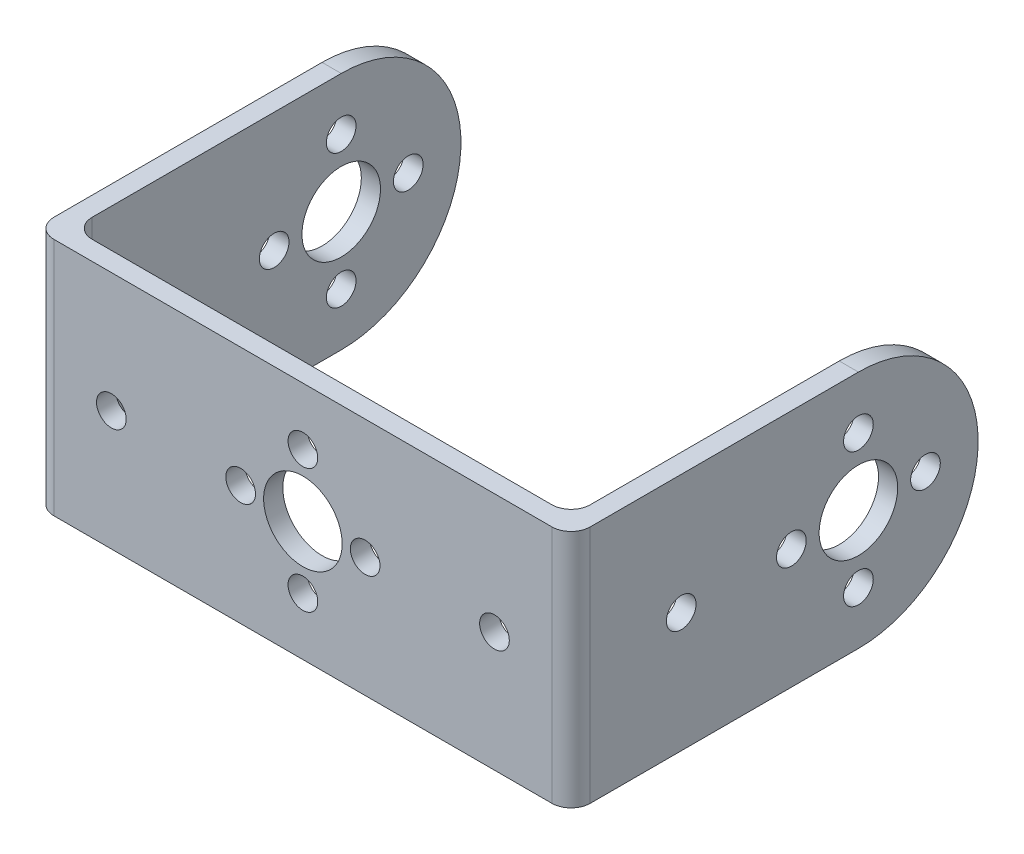
ISO-10303-21;
HEADER;
FILE_DESCRIPTION(('STEP AP214'),'2;1');
FILE_NAME('part.step','',(''),(''),'','','');
FILE_SCHEMA(('AUTOMOTIVE_DESIGN { 1 0 10303 214 1 1 1 1 }'));
ENDSEC;
DATA;
#1=APPLICATION_CONTEXT('core data for automotive mechanical design processes');
#2=APPLICATION_PROTOCOL_DEFINITION('international standard','automotive_design',2000,#1);
#3=PRODUCT_CONTEXT('',#1,'mechanical');
#4=PRODUCT('Part','Part','',(#3));
#5=PRODUCT_RELATED_PRODUCT_CATEGORY('part','',(#4));
#6=PRODUCT_DEFINITION_FORMATION('','',#4);
#7=PRODUCT_DEFINITION_CONTEXT('part definition',#1,'design');
#8=PRODUCT_DEFINITION('design','',#6,#7);
#9=PRODUCT_DEFINITION_SHAPE('','',#8);
#10=(LENGTH_UNIT() NAMED_UNIT(*) SI_UNIT(.MILLI.,.METRE.));
#11=(NAMED_UNIT(*) PLANE_ANGLE_UNIT() SI_UNIT($,.RADIAN.));
#12=(NAMED_UNIT(*) SI_UNIT($,.STERADIAN.) SOLID_ANGLE_UNIT());
#13=UNCERTAINTY_MEASURE_WITH_UNIT(LENGTH_MEASURE(1.E-05),#10,'distance_accuracy_value','');
#14=(GEOMETRIC_REPRESENTATION_CONTEXT(3) GLOBAL_UNCERTAINTY_ASSIGNED_CONTEXT((#13)) GLOBAL_UNIT_ASSIGNED_CONTEXT((#10,
#11,#12)) REPRESENTATION_CONTEXT('',''));
#15=CARTESIAN_POINT('',(0.,0.,0.));
#16=DIRECTION('',(0.,0.,1.));
#17=DIRECTION('',(1.,0.,0.));
#18=AXIS2_PLACEMENT_3D('',#15,#16,#17);
#19=CARTESIAN_POINT('',(0.,0.,0.));
#20=DIRECTION('',(0.,0.,-1.));
#21=DIRECTION('',(-1.,0.,0.));
#22=AXIS2_PLACEMENT_3D('',#19,#20,#21);
#23=PLANE('',#22);
#24=CARTESIAN_POINT('',(-20.,0.,0.));
#25=DIRECTION('',(0.,0.,1.));
#26=DIRECTION('',(1.,0.,0.));
#27=AXIS2_PLACEMENT_3D('',#24,#25,#26);
#28=CIRCLE('',#27,1.54999999999998);
#29=CARTESIAN_POINT('',(-18.45,0.,0.));
#30=VERTEX_POINT('',#29);
#31=EDGE_CURVE('E281',#30,#30,#28,.T.);
#32=ORIENTED_EDGE('',*,*,#31,.T.);
#33=EDGE_LOOP('',(#32));
#34=FACE_BOUND('',#33,.T.);
#35=CARTESIAN_POINT('',(20.,0.,0.));
#36=DIRECTION('',(0.,0.,1.));
#37=DIRECTION('',(1.,0.,0.));
#38=AXIS2_PLACEMENT_3D('',#35,#36,#37);
#39=CIRCLE('',#38,1.54999999999998);
#40=CARTESIAN_POINT('',(21.55,0.,0.));
#41=VERTEX_POINT('',#40);
#42=EDGE_CURVE('E456',#41,#41,#39,.T.);
#43=ORIENTED_EDGE('',*,*,#42,.T.);
#44=EDGE_LOOP('',(#43));
#45=FACE_BOUND('',#44,.T.);
#46=CARTESIAN_POINT('',(0.,6.49999999999998,0.));
#47=DIRECTION('',(0.,0.,1.));
#48=DIRECTION('',(1.,0.,0.));
#49=AXIS2_PLACEMENT_3D('',#46,#47,#48);
#50=CIRCLE('',#49,1.55000000000001);
#51=CARTESIAN_POINT('',(1.55000000000001,6.49999999999998,0.));
#52=VERTEX_POINT('',#51);
#53=EDGE_CURVE('E449',#52,#52,#50,.T.);
#54=ORIENTED_EDGE('',*,*,#53,.T.);
#55=EDGE_LOOP('',(#54));
#56=FACE_BOUND('',#55,.T.);
#57=CARTESIAN_POINT('',(-6.49999999999999,0.,0.));
#58=DIRECTION('',(0.,0.,1.));
#59=DIRECTION('',(1.,0.,0.));
#60=AXIS2_PLACEMENT_3D('',#57,#58,#59);
#61=CIRCLE('',#60,1.54999999999998);
#62=CARTESIAN_POINT('',(-4.95000000000001,0.,0.));
#63=VERTEX_POINT('',#62);
#64=EDGE_CURVE('E442',#63,#63,#61,.T.);
#65=ORIENTED_EDGE('',*,*,#64,.T.);
#66=EDGE_LOOP('',(#65));
#67=FACE_BOUND('',#66,.T.);
#68=CARTESIAN_POINT('',(6.50000000000001,0.,0.));
#69=DIRECTION('',(0.,0.,1.));
#70=DIRECTION('',(1.,0.,0.));
#71=AXIS2_PLACEMENT_3D('',#68,#69,#70);
#72=CIRCLE('',#71,1.54999999999998);
#73=CARTESIAN_POINT('',(8.04999999999999,0.,0.));
#74=VERTEX_POINT('',#73);
#75=EDGE_CURVE('E474',#74,#74,#72,.T.);
#76=ORIENTED_EDGE('',*,*,#75,.T.);
#77=EDGE_LOOP('',(#76));
#78=FACE_BOUND('',#77,.T.);
#79=CARTESIAN_POINT('',(0.,-6.5,0.));
#80=DIRECTION('',(0.,0.,1.));
#81=DIRECTION('',(1.,0.,0.));
#82=AXIS2_PLACEMENT_3D('',#79,#80,#81);
#83=CIRCLE('',#82,1.55000000000001);
#84=CARTESIAN_POINT('',(1.55000000000001,-6.5,0.));
#85=VERTEX_POINT('',#84);
#86=EDGE_CURVE('E462',#85,#85,#83,.T.);
#87=ORIENTED_EDGE('',*,*,#86,.T.);
#88=EDGE_LOOP('',(#87));
#89=FACE_BOUND('',#88,.T.);
#90=CARTESIAN_POINT('',(0.,0.,0.));
#91=DIRECTION('',(0.,0.,1.));
#92=DIRECTION('',(1.,0.,0.));
#93=AXIS2_PLACEMENT_3D('',#90,#91,#92);
#94=CIRCLE('',#93,4.09999999999999);
#95=CARTESIAN_POINT('',(4.09999999999999,0.,0.));
#96=VERTEX_POINT('',#95);
#97=EDGE_CURVE('E468',#96,#96,#94,.T.);
#98=ORIENTED_EDGE('',*,*,#97,.T.);
#99=EDGE_LOOP('',(#98));
#100=FACE_BOUND('',#99,.T.);
#101=DIRECTION('',(-1.,0.,0.));
#102=VECTOR('',#101,1.);
#103=CARTESIAN_POINT('',(-28.,12.5,0.));
#104=LINE('',#103,#102);
#105=CARTESIAN_POINT('',(24.,12.5,0.));
#106=VERTEX_POINT('',#105);
#107=CARTESIAN_POINT('',(-24.,12.5,0.));
#108=VERTEX_POINT('',#107);
#109=EDGE_CURVE('E199',#106,#108,#104,.T.);
#110=ORIENTED_EDGE('',*,*,#109,.F.);
#111=DIRECTION('',(0.,1.,0.));
#112=VECTOR('',#111,1.);
#113=CARTESIAN_POINT('',(24.,0.,0.));
#114=LINE('',#113,#112);
#115=CARTESIAN_POINT('',(24.,-12.5,0.));
#116=VERTEX_POINT('',#115);
#117=EDGE_CURVE('E226',#106,#116,#114,.F.);
#118=ORIENTED_EDGE('',*,*,#117,.T.);
#119=DIRECTION('',(1.,0.,0.));
#120=VECTOR('',#119,1.);
#121=CARTESIAN_POINT('',(-28.,-12.5,0.));
#122=LINE('',#121,#120);
#123=CARTESIAN_POINT('',(-24.,-12.5,0.));
#124=VERTEX_POINT('',#123);
#125=EDGE_CURVE('E206',#124,#116,#122,.T.);
#126=ORIENTED_EDGE('',*,*,#125,.F.);
#127=DIRECTION('',(0.,1.,0.));
#128=VECTOR('',#127,1.);
#129=CARTESIAN_POINT('',(-24.,0.,0.));
#130=LINE('',#129,#128);
#131=EDGE_CURVE('E223',#124,#108,#130,.T.);
#132=ORIENTED_EDGE('',*,*,#131,.T.);
#133=EDGE_LOOP('',(#110,#118,#126,#132));
#134=FACE_BOUND('',#133,.T.);
#135=ADVANCED_FACE('F33',(#34,#45,#56,#67,#78,#89,#100,#134),#23,.T.);
#136=CARTESIAN_POINT('',(28.,-12.5,2.));
#137=DIRECTION('',(-1.,0.,0.));
#138=DIRECTION('',(0.,0.,1.));
#139=AXIS2_PLACEMENT_3D('',#136,#137,#138);
#140=PLANE('',#139);
#141=DIRECTION('',(0.,0.,-1.));
#142=VECTOR('',#141,1.);
#143=CARTESIAN_POINT('',(28.,12.5,2.));
#144=LINE('',#143,#142);
#145=CARTESIAN_POINT('',(28.,12.5,0.));
#146=VERTEX_POINT('',#145);
#147=CARTESIAN_POINT('',(28.,12.5,-28.));
#148=VERTEX_POINT('',#147);
#149=EDGE_CURVE('E218',#146,#148,#144,.T.);
#150=ORIENTED_EDGE('',*,*,#149,.F.);
#151=DIRECTION('',(0.,1.,0.));
#152=VECTOR('',#151,1.);
#153=CARTESIAN_POINT('',(28.,-12.5,0.));
#154=LINE('',#153,#152);
#155=CARTESIAN_POINT('',(28.,-12.5,0.));
#156=VERTEX_POINT('',#155);
#157=EDGE_CURVE('E244',#146,#156,#154,.F.);
#158=ORIENTED_EDGE('',*,*,#157,.T.);
#159=DIRECTION('',(0.,0.,-1.));
#160=VECTOR('',#159,1.);
#161=CARTESIAN_POINT('',(28.,-12.5,2.));
#162=LINE('',#161,#160);
#163=CARTESIAN_POINT('',(28.,-12.5,-28.));
#164=VERTEX_POINT('',#163);
#165=EDGE_CURVE('E209',#156,#164,#162,.T.);
#166=ORIENTED_EDGE('',*,*,#165,.T.);
#167=CARTESIAN_POINT('',(28.,0.,-28.));
#168=DIRECTION('',(1.,0.,0.));
#169=DIRECTION('',(0.,0.,-1.));
#170=AXIS2_PLACEMENT_3D('',#167,#168,#169);
#171=CIRCLE('',#170,12.5);
#172=EDGE_CURVE('E153',#164,#148,#171,.T.);
#173=ORIENTED_EDGE('',*,*,#172,.T.);
#174=EDGE_LOOP('',(#150,#158,#166,#173));
#175=FACE_BOUND('',#174,.T.);
#176=CARTESIAN_POINT('',(28.,0.,-35.));
#177=DIRECTION('',(1.,0.,0.));
#178=DIRECTION('',(0.,0.,-1.));
#179=AXIS2_PLACEMENT_3D('',#176,#177,#178);
#180=CIRCLE('',#179,1.54999999999999);
#181=CARTESIAN_POINT('',(28.,0.,-36.55));
#182=VERTEX_POINT('',#181);
#183=EDGE_CURVE('E145',#182,#182,#180,.F.);
#184=ORIENTED_EDGE('',*,*,#183,.T.);
#185=EDGE_LOOP('',(#184));
#186=FACE_BOUND('',#185,.T.);
#187=CARTESIAN_POINT('',(28.,0.,-28.));
#188=DIRECTION('',(1.,0.,0.));
#189=DIRECTION('',(0.,0.,-1.));
#190=AXIS2_PLACEMENT_3D('',#187,#188,#189);
#191=CIRCLE('',#190,4.10000000000005);
#192=CARTESIAN_POINT('',(28.,0.,-32.1));
#193=VERTEX_POINT('',#192);
#194=EDGE_CURVE('E179',#193,#193,#191,.T.);
#195=ORIENTED_EDGE('',*,*,#194,.F.);
#196=EDGE_LOOP('',(#195));
#197=FACE_BOUND('',#196,.T.);
#198=CARTESIAN_POINT('',(28.,-7.00000000000001,-28.));
#199=DIRECTION('',(1.,0.,0.));
#200=DIRECTION('',(0.,0.,-1.));
#201=AXIS2_PLACEMENT_3D('',#198,#199,#200);
#202=CIRCLE('',#201,1.55);
#203=CARTESIAN_POINT('',(28.,-7.00000000000001,-29.55));
#204=VERTEX_POINT('',#203);
#205=EDGE_CURVE('E182',#204,#204,#202,.T.);
#206=ORIENTED_EDGE('',*,*,#205,.F.);
#207=EDGE_LOOP('',(#206));
#208=FACE_BOUND('',#207,.T.);
#209=CARTESIAN_POINT('',(28.,0.,-21.));
#210=DIRECTION('',(1.,0.,0.));
#211=DIRECTION('',(0.,0.,-1.));
#212=AXIS2_PLACEMENT_3D('',#209,#210,#211);
#213=CIRCLE('',#212,1.55000000000014);
#214=CARTESIAN_POINT('',(28.,0.,-22.5500000000001));
#215=VERTEX_POINT('',#214);
#216=EDGE_CURVE('E185',#215,#215,#213,.F.);
#217=ORIENTED_EDGE('',*,*,#216,.T.);
#218=EDGE_LOOP('',(#217));
#219=FACE_BOUND('',#218,.T.);
#220=CARTESIAN_POINT('',(28.,6.99999999999998,-28.));
#221=DIRECTION('',(1.,0.,0.));
#222=DIRECTION('',(0.,0.,-1.));
#223=AXIS2_PLACEMENT_3D('',#220,#221,#222);
#224=CIRCLE('',#223,1.55000000000002);
#225=CARTESIAN_POINT('',(28.,6.99999999999998,-29.55));
#226=VERTEX_POINT('',#225);
#227=EDGE_CURVE('E188',#226,#226,#224,.T.);
#228=ORIENTED_EDGE('',*,*,#227,.F.);
#229=EDGE_LOOP('',(#228));
#230=FACE_BOUND('',#229,.T.);
#231=CARTESIAN_POINT('',(28.,0.,-9.49999999999998));
#232=DIRECTION('',(1.,0.,0.));
#233=DIRECTION('',(0.,0.,-1.));
#234=AXIS2_PLACEMENT_3D('',#231,#232,#233);
#235=CIRCLE('',#234,1.54999999999999);
#236=CARTESIAN_POINT('',(28.,0.,-11.05));
#237=VERTEX_POINT('',#236);
#238=EDGE_CURVE('E191',#237,#237,#235,.F.);
#239=ORIENTED_EDGE('',*,*,#238,.T.);
#240=EDGE_LOOP('',(#239));
#241=FACE_BOUND('',#240,.T.);
#242=ADVANCED_FACE('F340',(#175,#186,#197,#208,#219,#230,#241),#140,.F.);
#243=CARTESIAN_POINT('',(-28.,12.5,2.));
#244=DIRECTION('',(0.,-1.,0.));
#245=DIRECTION('',(0.,0.,-1.));
#246=AXIS2_PLACEMENT_3D('',#243,#244,#245);
#247=PLANE('',#246);
#248=DIRECTION('',(0.,0.,-1.));
#249=VECTOR('',#248,1.);
#250=CARTESIAN_POINT('',(-28.,12.5,2.));
#251=LINE('',#250,#249);
#252=CARTESIAN_POINT('',(-28.,12.5,0.));
#253=VERTEX_POINT('',#252);
#254=CARTESIAN_POINT('',(-28.,12.5,-28.));
#255=VERTEX_POINT('',#254);
#256=EDGE_CURVE('E216',#253,#255,#251,.T.);
#257=ORIENTED_EDGE('',*,*,#256,.F.);
#258=CARTESIAN_POINT('',(-26.,12.5,0.));
#259=DIRECTION('',(0.,-1.,0.));
#260=DIRECTION('',(0.,0.,-1.));
#261=AXIS2_PLACEMENT_3D('',#258,#259,#260);
#262=CIRCLE('',#261,2.);
#263=CARTESIAN_POINT('',(-26.,12.5,2.));
#264=VERTEX_POINT('',#263);
#265=EDGE_CURVE('E242',#253,#264,#262,.F.);
#266=ORIENTED_EDGE('',*,*,#265,.T.);
#267=DIRECTION('',(-1.,0.,0.));
#268=VECTOR('',#267,1.);
#269=CARTESIAN_POINT('',(-28.,12.5,2.));
#270=LINE('',#269,#268);
#271=CARTESIAN_POINT('',(26.,12.5,2.));
#272=VERTEX_POINT('',#271);
#273=EDGE_CURVE('E202',#272,#264,#270,.T.);
#274=ORIENTED_EDGE('',*,*,#273,.F.);
#275=CARTESIAN_POINT('',(26.,12.5,0.));
#276=DIRECTION('',(0.,-1.,0.));
#277=DIRECTION('',(0.,0.,-1.));
#278=AXIS2_PLACEMENT_3D('',#275,#276,#277);
#279=CIRCLE('',#278,2.);
#280=EDGE_CURVE('E48',#272,#146,#279,.F.);
#281=ORIENTED_EDGE('',*,*,#280,.T.);
#282=ORIENTED_EDGE('',*,*,#149,.T.);
#283=DIRECTION('',(1.,0.,0.));
#284=VECTOR('',#283,1.);
#285=CARTESIAN_POINT('',(26.,12.5,-28.));
#286=LINE('',#285,#284);
#287=CARTESIAN_POINT('',(26.,12.5,-28.));
#288=VERTEX_POINT('',#287);
#289=EDGE_CURVE('E196',#288,#148,#286,.T.);
#290=ORIENTED_EDGE('',*,*,#289,.F.);
#291=DIRECTION('',(0.,0.,-1.));
#292=VECTOR('',#291,1.);
#293=CARTESIAN_POINT('',(26.,12.5,0.));
#294=LINE('',#293,#292);
#295=CARTESIAN_POINT('',(26.,12.5,-2.));
#296=VERTEX_POINT('',#295);
#297=EDGE_CURVE('E174',#296,#288,#294,.T.);
#298=ORIENTED_EDGE('',*,*,#297,.F.);
#299=CARTESIAN_POINT('',(24.,12.5,-2.));
#300=DIRECTION('',(0.,-1.,0.));
#301=DIRECTION('',(0.,0.,-1.));
#302=AXIS2_PLACEMENT_3D('',#299,#300,#301);
#303=CIRCLE('',#302,2.);
#304=EDGE_CURVE('E246',#296,#106,#303,.T.);
#305=ORIENTED_EDGE('',*,*,#304,.T.);
#306=ORIENTED_EDGE('',*,*,#109,.T.);
#307=CARTESIAN_POINT('',(-24.,12.5,-2.));
#308=DIRECTION('',(0.,-1.,0.));
#309=DIRECTION('',(0.,0.,-1.));
#310=AXIS2_PLACEMENT_3D('',#307,#308,#309);
#311=CIRCLE('',#310,2.);
#312=CARTESIAN_POINT('',(-26.,12.5,-2.));
#313=VERTEX_POINT('',#312);
#314=EDGE_CURVE('E41',#108,#313,#311,.T.);
#315=ORIENTED_EDGE('',*,*,#314,.T.);
#316=DIRECTION('',(0.,0.,-1.));
#317=VECTOR('',#316,1.);
#318=CARTESIAN_POINT('',(-26.,12.5,0.));
#319=LINE('',#318,#317);
#320=CARTESIAN_POINT('',(-26.,12.5,-28.));
#321=VERTEX_POINT('',#320);
#322=EDGE_CURVE('E121',#313,#321,#319,.T.);
#323=ORIENTED_EDGE('',*,*,#322,.T.);
#324=DIRECTION('',(-1.,0.,0.));
#325=VECTOR('',#324,1.);
#326=CARTESIAN_POINT('',(-26.,12.5,-28.));
#327=LINE('',#326,#325);
#328=EDGE_CURVE('E125',#321,#255,#327,.T.);
#329=ORIENTED_EDGE('',*,*,#328,.T.);
#330=EDGE_LOOP('',(#257,#266,#274,#281,#282,#290,#298,#305,#306,#315,#323,#329));
#331=FACE_BOUND('',#330,.T.);
#332=ADVANCED_FACE('F123',(#331),#247,.F.);
#333=CARTESIAN_POINT('',(-28.,-12.5,2.));
#334=DIRECTION('',(1.,0.,0.));
#335=DIRECTION('',(0.,0.,-1.));
#336=AXIS2_PLACEMENT_3D('',#333,#334,#335);
#337=PLANE('',#336);
#338=DIRECTION('',(0.,0.,-1.));
#339=VECTOR('',#338,1.);
#340=CARTESIAN_POINT('',(-28.,-12.5,2.));
#341=LINE('',#340,#339);
#342=CARTESIAN_POINT('',(-28.,-12.5,0.));
#343=VERTEX_POINT('',#342);
#344=CARTESIAN_POINT('',(-28.,-12.5,-28.));
#345=VERTEX_POINT('',#344);
#346=EDGE_CURVE('E214',#343,#345,#341,.T.);
#347=ORIENTED_EDGE('',*,*,#346,.F.);
#348=DIRECTION('',(0.,-1.,0.));
#349=VECTOR('',#348,1.);
#350=CARTESIAN_POINT('',(-28.,-12.5,0.));
#351=LINE('',#350,#349);
#352=EDGE_CURVE('E56',#343,#253,#351,.F.);
#353=ORIENTED_EDGE('',*,*,#352,.T.);
#354=ORIENTED_EDGE('',*,*,#256,.T.);
#355=CARTESIAN_POINT('',(-28.,0.,-28.));
#356=DIRECTION('',(1.,0.,0.));
#357=DIRECTION('',(0.,0.,-1.));
#358=AXIS2_PLACEMENT_3D('',#355,#356,#357);
#359=CIRCLE('',#358,12.5);
#360=EDGE_CURVE('E142',#345,#255,#359,.T.);
#361=ORIENTED_EDGE('',*,*,#360,.F.);
#362=EDGE_LOOP('',(#347,#353,#354,#361));
#363=FACE_BOUND('',#362,.T.);
#364=CARTESIAN_POINT('',(-28.,0.,-35.));
#365=DIRECTION('',(1.,0.,0.));
#366=DIRECTION('',(0.,0.,-1.));
#367=AXIS2_PLACEMENT_3D('',#364,#365,#366);
#368=CIRCLE('',#367,1.54999999999999);
#369=CARTESIAN_POINT('',(-28.,0.,-36.55));
#370=VERTEX_POINT('',#369);
#371=EDGE_CURVE('E277',#370,#370,#368,.F.);
#372=ORIENTED_EDGE('',*,*,#371,.F.);
#373=EDGE_LOOP('',(#372));
#374=FACE_BOUND('',#373,.T.);
#375=CARTESIAN_POINT('',(-28.,0.,-28.));
#376=DIRECTION('',(1.,0.,0.));
#377=DIRECTION('',(0.,0.,-1.));
#378=AXIS2_PLACEMENT_3D('',#375,#376,#377);
#379=CIRCLE('',#378,4.10000000000005);
#380=CARTESIAN_POINT('',(-28.,0.,-32.1));
#381=VERTEX_POINT('',#380);
#382=EDGE_CURVE('E280',#381,#381,#379,.T.);
#383=ORIENTED_EDGE('',*,*,#382,.T.);
#384=EDGE_LOOP('',(#383));
#385=FACE_BOUND('',#384,.T.);
#386=CARTESIAN_POINT('',(-28.,-7.00000000000001,-28.));
#387=DIRECTION('',(1.,0.,0.));
#388=DIRECTION('',(0.,0.,-1.));
#389=AXIS2_PLACEMENT_3D('',#386,#387,#388);
#390=CIRCLE('',#389,1.55);
#391=CARTESIAN_POINT('',(-28.,-7.00000000000001,-29.55));
#392=VERTEX_POINT('',#391);
#393=EDGE_CURVE('E284',#392,#392,#390,.T.);
#394=ORIENTED_EDGE('',*,*,#393,.T.);
#395=EDGE_LOOP('',(#394));
#396=FACE_BOUND('',#395,.T.);
#397=CARTESIAN_POINT('',(-28.,0.,-21.));
#398=DIRECTION('',(1.,0.,0.));
#399=DIRECTION('',(0.,0.,-1.));
#400=AXIS2_PLACEMENT_3D('',#397,#398,#399);
#401=CIRCLE('',#400,1.55000000000014);
#402=CARTESIAN_POINT('',(-28.,0.,-22.5500000000001));
#403=VERTEX_POINT('',#402);
#404=EDGE_CURVE('E287',#403,#403,#401,.F.);
#405=ORIENTED_EDGE('',*,*,#404,.F.);
#406=EDGE_LOOP('',(#405));
#407=FACE_BOUND('',#406,.T.);
#408=CARTESIAN_POINT('',(-28.,6.99999999999998,-28.));
#409=DIRECTION('',(1.,0.,0.));
#410=DIRECTION('',(0.,0.,-1.));
#411=AXIS2_PLACEMENT_3D('',#408,#409,#410);
#412=CIRCLE('',#411,1.55000000000002);
#413=CARTESIAN_POINT('',(-28.,6.99999999999998,-29.55));
#414=VERTEX_POINT('',#413);
#415=EDGE_CURVE('E290',#414,#414,#412,.T.);
#416=ORIENTED_EDGE('',*,*,#415,.T.);
#417=EDGE_LOOP('',(#416));
#418=FACE_BOUND('',#417,.T.);
#419=CARTESIAN_POINT('',(-28.,0.,-9.49999999999998));
#420=DIRECTION('',(1.,0.,0.));
#421=DIRECTION('',(0.,0.,-1.));
#422=AXIS2_PLACEMENT_3D('',#419,#420,#421);
#423=CIRCLE('',#422,1.54999999999999);
#424=CARTESIAN_POINT('',(-28.,0.,-11.05));
#425=VERTEX_POINT('',#424);
#426=EDGE_CURVE('E293',#425,#425,#423,.F.);
#427=ORIENTED_EDGE('',*,*,#426,.F.);
#428=EDGE_LOOP('',(#427));
#429=FACE_BOUND('',#428,.T.);
#430=ADVANCED_FACE('F331',(#363,#374,#385,#396,#407,#418,#429),#337,.F.);
#431=CARTESIAN_POINT('',(-28.,-12.5,2.));
#432=DIRECTION('',(0.,1.,0.));
#433=DIRECTION('',(0.,0.,1.));
#434=AXIS2_PLACEMENT_3D('',#431,#432,#433);
#435=PLANE('',#434);
#436=DIRECTION('',(1.,0.,0.));
#437=VECTOR('',#436,1.);
#438=CARTESIAN_POINT('',(-28.,-12.5,2.));
#439=LINE('',#438,#437);
#440=CARTESIAN_POINT('',(-26.,-12.5,2.));
#441=VERTEX_POINT('',#440);
#442=CARTESIAN_POINT('',(26.,-12.5,2.));
#443=VERTEX_POINT('',#442);
#444=EDGE_CURVE('E205',#441,#443,#439,.T.);
#445=ORIENTED_EDGE('',*,*,#444,.F.);
#446=CARTESIAN_POINT('',(-26.,-12.5,0.));
#447=DIRECTION('',(0.,1.,0.));
#448=DIRECTION('',(0.,0.,1.));
#449=AXIS2_PLACEMENT_3D('',#446,#447,#448);
#450=CIRCLE('',#449,2.);
#451=EDGE_CURVE('E238',#441,#343,#450,.F.);
#452=ORIENTED_EDGE('',*,*,#451,.T.);
#453=ORIENTED_EDGE('',*,*,#346,.T.);
#454=DIRECTION('',(-1.,0.,0.));
#455=VECTOR('',#454,1.);
#456=CARTESIAN_POINT('',(-26.,-12.5,-28.));
#457=LINE('',#456,#455);
#458=CARTESIAN_POINT('',(-26.,-12.5,-28.));
#459=VERTEX_POINT('',#458);
#460=EDGE_CURVE('E143',#459,#345,#457,.T.);
#461=ORIENTED_EDGE('',*,*,#460,.F.);
#462=DIRECTION('',(0.,0.,1.));
#463=VECTOR('',#462,1.);
#464=CARTESIAN_POINT('',(-26.,-12.5,0.));
#465=LINE('',#464,#463);
#466=CARTESIAN_POINT('',(-26.,-12.5,-2.));
#467=VERTEX_POINT('',#466);
#468=EDGE_CURVE('E131',#459,#467,#465,.T.);
#469=ORIENTED_EDGE('',*,*,#468,.T.);
#470=CARTESIAN_POINT('',(-24.,-12.5,-2.));
#471=DIRECTION('',(0.,1.,0.));
#472=DIRECTION('',(0.,0.,1.));
#473=AXIS2_PLACEMENT_3D('',#470,#471,#472);
#474=CIRCLE('',#473,2.);
#475=EDGE_CURVE('E11',#467,#124,#474,.T.);
#476=ORIENTED_EDGE('',*,*,#475,.T.);
#477=ORIENTED_EDGE('',*,*,#125,.T.);
#478=CARTESIAN_POINT('',(24.,-12.5,-2.));
#479=DIRECTION('',(0.,1.,0.));
#480=DIRECTION('',(0.,0.,1.));
#481=AXIS2_PLACEMENT_3D('',#478,#479,#480);
#482=CIRCLE('',#481,2.);
#483=CARTESIAN_POINT('',(26.,-12.5,-2.));
#484=VERTEX_POINT('',#483);
#485=EDGE_CURVE('E248',#116,#484,#482,.T.);
#486=ORIENTED_EDGE('',*,*,#485,.T.);
#487=DIRECTION('',(0.,0.,1.));
#488=VECTOR('',#487,1.);
#489=CARTESIAN_POINT('',(26.,-12.5,0.));
#490=LINE('',#489,#488);
#491=CARTESIAN_POINT('',(26.,-12.5,-28.));
#492=VERTEX_POINT('',#491);
#493=EDGE_CURVE('E168',#492,#484,#490,.T.);
#494=ORIENTED_EDGE('',*,*,#493,.F.);
#495=DIRECTION('',(1.,0.,0.));
#496=VECTOR('',#495,1.);
#497=CARTESIAN_POINT('',(26.,-12.5,-28.));
#498=LINE('',#497,#496);
#499=EDGE_CURVE('E176',#492,#164,#498,.T.);
#500=ORIENTED_EDGE('',*,*,#499,.T.);
#501=ORIENTED_EDGE('',*,*,#165,.F.);
#502=CARTESIAN_POINT('',(26.,-12.5,0.));
#503=DIRECTION('',(0.,1.,0.));
#504=DIRECTION('',(0.,0.,1.));
#505=AXIS2_PLACEMENT_3D('',#502,#503,#504);
#506=CIRCLE('',#505,2.);
#507=EDGE_CURVE('E236',#156,#443,#506,.F.);
#508=ORIENTED_EDGE('',*,*,#507,.T.);
#509=EDGE_LOOP('',(#445,#452,#453,#461,#469,#476,#477,#486,#494,#500,#501,#508));
#510=FACE_BOUND('',#509,.T.);
#511=ADVANCED_FACE('F253',(#510),#435,.F.);
#512=CARTESIAN_POINT('',(0.,0.,2.));
#513=DIRECTION('',(0.,0.,-1.));
#514=DIRECTION('',(-1.,0.,0.));
#515=AXIS2_PLACEMENT_3D('',#512,#513,#514);
#516=PLANE('',#515);
#517=CARTESIAN_POINT('',(-20.,0.,2.));
#518=DIRECTION('',(0.,0.,1.));
#519=DIRECTION('',(1.,0.,0.));
#520=AXIS2_PLACEMENT_3D('',#517,#518,#519);
#521=CIRCLE('',#520,1.54999999999998);
#522=CARTESIAN_POINT('',(-18.45,0.,2.));
#523=VERTEX_POINT('',#522);
#524=EDGE_CURVE('E441',#523,#523,#521,.T.);
#525=ORIENTED_EDGE('',*,*,#524,.F.);
#526=EDGE_LOOP('',(#525));
#527=FACE_BOUND('',#526,.T.);
#528=CARTESIAN_POINT('',(20.,0.,2.));
#529=DIRECTION('',(0.,0.,1.));
#530=DIRECTION('',(1.,0.,0.));
#531=AXIS2_PLACEMENT_3D('',#528,#529,#530);
#532=CIRCLE('',#531,1.54999999999998);
#533=CARTESIAN_POINT('',(21.55,0.,2.));
#534=VERTEX_POINT('',#533);
#535=EDGE_CURVE('E459',#534,#534,#532,.T.);
#536=ORIENTED_EDGE('',*,*,#535,.F.);
#537=EDGE_LOOP('',(#536));
#538=FACE_BOUND('',#537,.T.);
#539=CARTESIAN_POINT('',(0.,6.49999999999998,2.));
#540=DIRECTION('',(0.,0.,1.));
#541=DIRECTION('',(1.,0.,0.));
#542=AXIS2_PLACEMENT_3D('',#539,#540,#541);
#543=CIRCLE('',#542,1.55000000000001);
#544=CARTESIAN_POINT('',(1.55000000000001,6.49999999999998,2.));
#545=VERTEX_POINT('',#544);
#546=EDGE_CURVE('E453',#545,#545,#543,.T.);
#547=ORIENTED_EDGE('',*,*,#546,.F.);
#548=EDGE_LOOP('',(#547));
#549=FACE_BOUND('',#548,.T.);
#550=CARTESIAN_POINT('',(-6.49999999999999,0.,2.));
#551=DIRECTION('',(0.,0.,1.));
#552=DIRECTION('',(1.,0.,0.));
#553=AXIS2_PLACEMENT_3D('',#550,#551,#552);
#554=CIRCLE('',#553,1.54999999999998);
#555=CARTESIAN_POINT('',(-4.95000000000001,0.,2.));
#556=VERTEX_POINT('',#555);
#557=EDGE_CURVE('E446',#556,#556,#554,.T.);
#558=ORIENTED_EDGE('',*,*,#557,.F.);
#559=EDGE_LOOP('',(#558));
#560=FACE_BOUND('',#559,.T.);
#561=CARTESIAN_POINT('',(6.50000000000001,0.,2.));
#562=DIRECTION('',(0.,0.,1.));
#563=DIRECTION('',(1.,0.,0.));
#564=AXIS2_PLACEMENT_3D('',#561,#562,#563);
#565=CIRCLE('',#564,1.54999999999998);
#566=CARTESIAN_POINT('',(8.04999999999999,0.,2.));
#567=VERTEX_POINT('',#566);
#568=EDGE_CURVE('E305',#567,#567,#565,.T.);
#569=ORIENTED_EDGE('',*,*,#568,.F.);
#570=EDGE_LOOP('',(#569));
#571=FACE_BOUND('',#570,.T.);
#572=CARTESIAN_POINT('',(0.,-6.5,2.));
#573=DIRECTION('',(0.,0.,1.));
#574=DIRECTION('',(1.,0.,0.));
#575=AXIS2_PLACEMENT_3D('',#572,#573,#574);
#576=CIRCLE('',#575,1.55000000000001);
#577=CARTESIAN_POINT('',(1.55000000000001,-6.5,2.));
#578=VERTEX_POINT('',#577);
#579=EDGE_CURVE('E465',#578,#578,#576,.T.);
#580=ORIENTED_EDGE('',*,*,#579,.F.);
#581=EDGE_LOOP('',(#580));
#582=FACE_BOUND('',#581,.T.);
#583=CARTESIAN_POINT('',(0.,0.,2.));
#584=DIRECTION('',(0.,0.,1.));
#585=DIRECTION('',(1.,0.,0.));
#586=AXIS2_PLACEMENT_3D('',#583,#584,#585);
#587=CIRCLE('',#586,4.09999999999999);
#588=CARTESIAN_POINT('',(4.09999999999999,0.,2.));
#589=VERTEX_POINT('',#588);
#590=EDGE_CURVE('E452',#589,#589,#587,.T.);
#591=ORIENTED_EDGE('',*,*,#590,.F.);
#592=EDGE_LOOP('',(#591));
#593=FACE_BOUND('',#592,.T.);
#594=ORIENTED_EDGE('',*,*,#273,.T.);
#595=DIRECTION('',(0.,-1.,0.));
#596=VECTOR('',#595,1.);
#597=CARTESIAN_POINT('',(-26.,0.,2.));
#598=LINE('',#597,#596);
#599=EDGE_CURVE('E233',#264,#441,#598,.T.);
#600=ORIENTED_EDGE('',*,*,#599,.T.);
#601=ORIENTED_EDGE('',*,*,#444,.T.);
#602=DIRECTION('',(0.,1.,0.));
#603=VECTOR('',#602,1.);
#604=CARTESIAN_POINT('',(26.,0.,2.));
#605=LINE('',#604,#603);
#606=EDGE_CURVE('E230',#443,#272,#605,.T.);
#607=ORIENTED_EDGE('',*,*,#606,.T.);
#608=EDGE_LOOP('',(#594,#600,#601,#607));
#609=FACE_BOUND('',#608,.T.);
#610=ADVANCED_FACE('F338',(#527,#538,#549,#560,#571,#582,#593,#609),#516,.F.);
#611=CARTESIAN_POINT('',(26.,0.,-9.49999999999998));
#612=DIRECTION('',(1.,0.,0.));
#613=DIRECTION('',(0.,0.,-1.));
#614=AXIS2_PLACEMENT_3D('',#611,#612,#613);
#615=CYLINDRICAL_SURFACE('',#614,1.54999999999999);
#616=CARTESIAN_POINT('',(26.,0.,-9.49999999999998));
#617=DIRECTION('',(1.,0.,0.));
#618=DIRECTION('',(0.,0.,-1.));
#619=AXIS2_PLACEMENT_3D('',#616,#617,#618);
#620=CIRCLE('',#619,1.54999999999999);
#621=CARTESIAN_POINT('',(26.,0.,-11.05));
#622=VERTEX_POINT('',#621);
#623=EDGE_CURVE('E165',#622,#622,#620,.F.);
#624=ORIENTED_EDGE('',*,*,#623,.T.);
#625=EDGE_LOOP('',(#624));
#626=FACE_BOUND('',#625,.T.);
#627=ORIENTED_EDGE('',*,*,#238,.F.);
#628=EDGE_LOOP('',(#627));
#629=FACE_BOUND('',#628,.T.);
#630=ADVANCED_FACE('F356',(#626,#629),#615,.F.);
#631=CARTESIAN_POINT('',(26.,6.99999999999998,-28.));
#632=DIRECTION('',(1.,0.,0.));
#633=DIRECTION('',(0.,0.,-1.));
#634=AXIS2_PLACEMENT_3D('',#631,#632,#633);
#635=CYLINDRICAL_SURFACE('',#634,1.55000000000002);
#636=CARTESIAN_POINT('',(26.,6.99999999999998,-28.));
#637=DIRECTION('',(1.,0.,0.));
#638=DIRECTION('',(0.,0.,-1.));
#639=AXIS2_PLACEMENT_3D('',#636,#637,#638);
#640=CIRCLE('',#639,1.55000000000002);
#641=CARTESIAN_POINT('',(26.,6.99999999999998,-29.55));
#642=VERTEX_POINT('',#641);
#643=EDGE_CURVE('E162',#642,#642,#640,.T.);
#644=ORIENTED_EDGE('',*,*,#643,.F.);
#645=EDGE_LOOP('',(#644));
#646=FACE_BOUND('',#645,.T.);
#647=ORIENTED_EDGE('',*,*,#227,.T.);
#648=EDGE_LOOP('',(#647));
#649=FACE_BOUND('',#648,.T.);
#650=ADVANCED_FACE('F374',(#646,#649),#635,.F.);
#651=CARTESIAN_POINT('',(26.,0.,-21.));
#652=DIRECTION('',(1.,0.,0.));
#653=DIRECTION('',(0.,0.,-1.));
#654=AXIS2_PLACEMENT_3D('',#651,#652,#653);
#655=CYLINDRICAL_SURFACE('',#654,1.55000000000014);
#656=CARTESIAN_POINT('',(26.,0.,-21.));
#657=DIRECTION('',(1.,0.,0.));
#658=DIRECTION('',(0.,0.,-1.));
#659=AXIS2_PLACEMENT_3D('',#656,#657,#658);
#660=CIRCLE('',#659,1.55000000000014);
#661=CARTESIAN_POINT('',(26.,0.,-22.5500000000001));
#662=VERTEX_POINT('',#661);
#663=EDGE_CURVE('E159',#662,#662,#660,.F.);
#664=ORIENTED_EDGE('',*,*,#663,.T.);
#665=EDGE_LOOP('',(#664));
#666=FACE_BOUND('',#665,.T.);
#667=ORIENTED_EDGE('',*,*,#216,.F.);
#668=EDGE_LOOP('',(#667));
#669=FACE_BOUND('',#668,.T.);
#670=ADVANCED_FACE('F370',(#666,#669),#655,.F.);
#671=CARTESIAN_POINT('',(26.,-7.00000000000001,-28.));
#672=DIRECTION('',(1.,0.,0.));
#673=DIRECTION('',(0.,0.,-1.));
#674=AXIS2_PLACEMENT_3D('',#671,#672,#673);
#675=CYLINDRICAL_SURFACE('',#674,1.55);
#676=CARTESIAN_POINT('',(26.,-7.00000000000001,-28.));
#677=DIRECTION('',(1.,0.,0.));
#678=DIRECTION('',(0.,0.,-1.));
#679=AXIS2_PLACEMENT_3D('',#676,#677,#678);
#680=CIRCLE('',#679,1.55);
#681=CARTESIAN_POINT('',(26.,-7.00000000000001,-29.55));
#682=VERTEX_POINT('',#681);
#683=EDGE_CURVE('E156',#682,#682,#680,.T.);
#684=ORIENTED_EDGE('',*,*,#683,.F.);
#685=EDGE_LOOP('',(#684));
#686=FACE_BOUND('',#685,.T.);
#687=ORIENTED_EDGE('',*,*,#205,.T.);
#688=EDGE_LOOP('',(#687));
#689=FACE_BOUND('',#688,.T.);
#690=ADVANCED_FACE('F366',(#686,#689),#675,.F.);
#691=CARTESIAN_POINT('',(26.,0.,-28.));
#692=DIRECTION('',(1.,0.,0.));
#693=DIRECTION('',(0.,0.,-1.));
#694=AXIS2_PLACEMENT_3D('',#691,#692,#693);
#695=CYLINDRICAL_SURFACE('',#694,4.10000000000005);
#696=CARTESIAN_POINT('',(26.,0.,-28.));
#697=DIRECTION('',(1.,0.,0.));
#698=DIRECTION('',(0.,0.,-1.));
#699=AXIS2_PLACEMENT_3D('',#696,#697,#698);
#700=CIRCLE('',#699,4.10000000000005);
#701=CARTESIAN_POINT('',(26.,0.,-32.1));
#702=VERTEX_POINT('',#701);
#703=EDGE_CURVE('E152',#702,#702,#700,.T.);
#704=ORIENTED_EDGE('',*,*,#703,.F.);
#705=EDGE_LOOP('',(#704));
#706=FACE_BOUND('',#705,.T.);
#707=ORIENTED_EDGE('',*,*,#194,.T.);
#708=EDGE_LOOP('',(#707));
#709=FACE_BOUND('',#708,.T.);
#710=ADVANCED_FACE('F362',(#706,#709),#695,.F.);
#711=CARTESIAN_POINT('',(26.,0.,-35.));
#712=DIRECTION('',(1.,0.,0.));
#713=DIRECTION('',(0.,0.,-1.));
#714=AXIS2_PLACEMENT_3D('',#711,#712,#713);
#715=CYLINDRICAL_SURFACE('',#714,1.54999999999999);
#716=CARTESIAN_POINT('',(26.,0.,-35.));
#717=DIRECTION('',(1.,0.,0.));
#718=DIRECTION('',(0.,0.,-1.));
#719=AXIS2_PLACEMENT_3D('',#716,#717,#718);
#720=CIRCLE('',#719,1.54999999999999);
#721=CARTESIAN_POINT('',(26.,0.,-36.55));
#722=VERTEX_POINT('',#721);
#723=EDGE_CURVE('E149',#722,#722,#720,.F.);
#724=ORIENTED_EDGE('',*,*,#723,.T.);
#725=EDGE_LOOP('',(#724));
#726=FACE_BOUND('',#725,.T.);
#727=ORIENTED_EDGE('',*,*,#183,.F.);
#728=EDGE_LOOP('',(#727));
#729=FACE_BOUND('',#728,.T.);
#730=ADVANCED_FACE('F358',(#726,#729),#715,.F.);
#731=CARTESIAN_POINT('',(26.,0.,-28.));
#732=DIRECTION('',(1.,0.,0.));
#733=DIRECTION('',(0.,0.,-1.));
#734=AXIS2_PLACEMENT_3D('',#731,#732,#733);
#735=CYLINDRICAL_SURFACE('',#734,12.5);
#736=ORIENTED_EDGE('',*,*,#172,.F.);
#737=ORIENTED_EDGE('',*,*,#499,.F.);
#738=CARTESIAN_POINT('',(26.,0.,-28.));
#739=DIRECTION('',(1.,0.,0.));
#740=DIRECTION('',(0.,0.,-1.));
#741=AXIS2_PLACEMENT_3D('',#738,#739,#740);
#742=CIRCLE('',#741,12.5);
#743=EDGE_CURVE('E171',#492,#288,#742,.T.);
#744=ORIENTED_EDGE('',*,*,#743,.T.);
#745=ORIENTED_EDGE('',*,*,#289,.T.);
#746=EDGE_LOOP('',(#736,#737,#744,#745));
#747=FACE_BOUND('',#746,.T.);
#748=ADVANCED_FACE('F361',(#747),#735,.T.);
#749=CARTESIAN_POINT('',(26.,0.,0.));
#750=DIRECTION('',(1.,0.,0.));
#751=DIRECTION('',(0.,0.,-1.));
#752=AXIS2_PLACEMENT_3D('',#749,#750,#751);
#753=PLANE('',#752);
#754=ORIENTED_EDGE('',*,*,#723,.F.);
#755=EDGE_LOOP('',(#754));
#756=FACE_BOUND('',#755,.T.);
#757=ORIENTED_EDGE('',*,*,#703,.T.);
#758=EDGE_LOOP('',(#757));
#759=FACE_BOUND('',#758,.T.);
#760=ORIENTED_EDGE('',*,*,#683,.T.);
#761=EDGE_LOOP('',(#760));
#762=FACE_BOUND('',#761,.T.);
#763=ORIENTED_EDGE('',*,*,#663,.F.);
#764=EDGE_LOOP('',(#763));
#765=FACE_BOUND('',#764,.T.);
#766=ORIENTED_EDGE('',*,*,#643,.T.);
#767=EDGE_LOOP('',(#766));
#768=FACE_BOUND('',#767,.T.);
#769=ORIENTED_EDGE('',*,*,#623,.F.);
#770=EDGE_LOOP('',(#769));
#771=FACE_BOUND('',#770,.T.);
#772=ORIENTED_EDGE('',*,*,#493,.T.);
#773=DIRECTION('',(0.,1.,0.));
#774=VECTOR('',#773,1.);
#775=CARTESIAN_POINT('',(26.,0.,-2.));
#776=LINE('',#775,#774);
#777=EDGE_CURVE('E220',#484,#296,#776,.T.);
#778=ORIENTED_EDGE('',*,*,#777,.T.);
#779=ORIENTED_EDGE('',*,*,#297,.T.);
#780=ORIENTED_EDGE('',*,*,#743,.F.);
#781=EDGE_LOOP('',(#772,#778,#779,#780));
#782=FACE_BOUND('',#781,.T.);
#783=ADVANCED_FACE('F260',(#756,#759,#762,#765,#768,#771,#782),#753,.F.);
#784=CARTESIAN_POINT('',(-26.,0.,-28.));
#785=DIRECTION('',(-1.,0.,0.));
#786=DIRECTION('',(0.,0.,1.));
#787=AXIS2_PLACEMENT_3D('',#784,#785,#786);
#788=CYLINDRICAL_SURFACE('',#787,12.5);
#789=ORIENTED_EDGE('',*,*,#360,.T.);
#790=ORIENTED_EDGE('',*,*,#328,.F.);
#791=CARTESIAN_POINT('',(-26.,0.,-28.));
#792=DIRECTION('',(1.,0.,0.));
#793=DIRECTION('',(0.,0.,-1.));
#794=AXIS2_PLACEMENT_3D('',#791,#792,#793);
#795=CIRCLE('',#794,12.5);
#796=EDGE_CURVE('E130',#459,#321,#795,.T.);
#797=ORIENTED_EDGE('',*,*,#796,.F.);
#798=ORIENTED_EDGE('',*,*,#460,.T.);
#799=EDGE_LOOP('',(#789,#790,#797,#798));
#800=FACE_BOUND('',#799,.T.);
#801=ADVANCED_FACE('F140',(#800),#788,.T.);
#802=CARTESIAN_POINT('',(-26.,0.,-9.49999999999998));
#803=DIRECTION('',(-1.,0.,0.));
#804=DIRECTION('',(0.,0.,1.));
#805=AXIS2_PLACEMENT_3D('',#802,#803,#804);
#806=CYLINDRICAL_SURFACE('',#805,1.54999999999999);
#807=CARTESIAN_POINT('',(-26.,0.,-9.49999999999998));
#808=DIRECTION('',(1.,0.,0.));
#809=DIRECTION('',(0.,0.,-1.));
#810=AXIS2_PLACEMENT_3D('',#807,#808,#809);
#811=CIRCLE('',#810,1.54999999999999);
#812=CARTESIAN_POINT('',(-26.,0.,-11.05));
#813=VERTEX_POINT('',#812);
#814=EDGE_CURVE('E270',#813,#813,#811,.F.);
#815=ORIENTED_EDGE('',*,*,#814,.F.);
#816=EDGE_LOOP('',(#815));
#817=FACE_BOUND('',#816,.T.);
#818=ORIENTED_EDGE('',*,*,#426,.T.);
#819=EDGE_LOOP('',(#818));
#820=FACE_BOUND('',#819,.T.);
#821=ADVANCED_FACE('F325',(#817,#820),#806,.F.);
#822=CARTESIAN_POINT('',(-26.,6.99999999999998,-28.));
#823=DIRECTION('',(-1.,0.,0.));
#824=DIRECTION('',(0.,0.,1.));
#825=AXIS2_PLACEMENT_3D('',#822,#823,#824);
#826=CYLINDRICAL_SURFACE('',#825,1.55000000000002);
#827=CARTESIAN_POINT('',(-26.,6.99999999999998,-28.));
#828=DIRECTION('',(1.,0.,0.));
#829=DIRECTION('',(0.,0.,-1.));
#830=AXIS2_PLACEMENT_3D('',#827,#828,#829);
#831=CIRCLE('',#830,1.55000000000002);
#832=CARTESIAN_POINT('',(-26.,6.99999999999998,-29.55));
#833=VERTEX_POINT('',#832);
#834=EDGE_CURVE('E273',#833,#833,#831,.T.);
#835=ORIENTED_EDGE('',*,*,#834,.T.);
#836=EDGE_LOOP('',(#835));
#837=FACE_BOUND('',#836,.T.);
#838=ORIENTED_EDGE('',*,*,#415,.F.);
#839=EDGE_LOOP('',(#838));
#840=FACE_BOUND('',#839,.T.);
#841=ADVANCED_FACE('F315',(#837,#840),#826,.F.);
#842=CARTESIAN_POINT('',(-26.,0.,-21.));
#843=DIRECTION('',(-1.,0.,0.));
#844=DIRECTION('',(0.,0.,1.));
#845=AXIS2_PLACEMENT_3D('',#842,#843,#844);
#846=CYLINDRICAL_SURFACE('',#845,1.55000000000014);
#847=CARTESIAN_POINT('',(-26.,0.,-21.));
#848=DIRECTION('',(1.,0.,0.));
#849=DIRECTION('',(0.,0.,-1.));
#850=AXIS2_PLACEMENT_3D('',#847,#848,#849);
#851=CIRCLE('',#850,1.55000000000014);
#852=CARTESIAN_POINT('',(-26.,0.,-22.5500000000001));
#853=VERTEX_POINT('',#852);
#854=EDGE_CURVE('E310',#853,#853,#851,.F.);
#855=ORIENTED_EDGE('',*,*,#854,.F.);
#856=EDGE_LOOP('',(#855));
#857=FACE_BOUND('',#856,.T.);
#858=ORIENTED_EDGE('',*,*,#404,.T.);
#859=EDGE_LOOP('',(#858));
#860=FACE_BOUND('',#859,.T.);
#861=ADVANCED_FACE('F398',(#857,#860),#846,.F.);
#862=CARTESIAN_POINT('',(-26.,-7.00000000000001,-28.));
#863=DIRECTION('',(-1.,0.,0.));
#864=DIRECTION('',(0.,0.,1.));
#865=AXIS2_PLACEMENT_3D('',#862,#863,#864);
#866=CYLINDRICAL_SURFACE('',#865,1.55);
#867=CARTESIAN_POINT('',(-26.,-7.00000000000001,-28.));
#868=DIRECTION('',(1.,0.,0.));
#869=DIRECTION('',(0.,0.,-1.));
#870=AXIS2_PLACEMENT_3D('',#867,#868,#869);
#871=CIRCLE('',#870,1.55);
#872=CARTESIAN_POINT('',(-26.,-7.00000000000001,-29.55));
#873=VERTEX_POINT('',#872);
#874=EDGE_CURVE('E302',#873,#873,#871,.T.);
#875=ORIENTED_EDGE('',*,*,#874,.T.);
#876=EDGE_LOOP('',(#875));
#877=FACE_BOUND('',#876,.T.);
#878=ORIENTED_EDGE('',*,*,#393,.F.);
#879=EDGE_LOOP('',(#878));
#880=FACE_BOUND('',#879,.T.);
#881=ADVANCED_FACE('F394',(#877,#880),#866,.F.);
#882=CARTESIAN_POINT('',(-26.,0.,-28.));
#883=DIRECTION('',(-1.,0.,0.));
#884=DIRECTION('',(0.,0.,1.));
#885=AXIS2_PLACEMENT_3D('',#882,#883,#884);
#886=CYLINDRICAL_SURFACE('',#885,4.10000000000005);
#887=CARTESIAN_POINT('',(-26.,0.,-28.));
#888=DIRECTION('',(1.,0.,0.));
#889=DIRECTION('',(0.,0.,-1.));
#890=AXIS2_PLACEMENT_3D('',#887,#888,#889);
#891=CIRCLE('',#890,4.10000000000005);
#892=CARTESIAN_POINT('',(-26.,0.,-32.1));
#893=VERTEX_POINT('',#892);
#894=EDGE_CURVE('E297',#893,#893,#891,.T.);
#895=ORIENTED_EDGE('',*,*,#894,.T.);
#896=EDGE_LOOP('',(#895));
#897=FACE_BOUND('',#896,.T.);
#898=ORIENTED_EDGE('',*,*,#382,.F.);
#899=EDGE_LOOP('',(#898));
#900=FACE_BOUND('',#899,.T.);
#901=ADVANCED_FACE('F390',(#897,#900),#886,.F.);
#902=CARTESIAN_POINT('',(-26.,0.,-35.));
#903=DIRECTION('',(-1.,0.,0.));
#904=DIRECTION('',(0.,0.,1.));
#905=AXIS2_PLACEMENT_3D('',#902,#903,#904);
#906=CYLINDRICAL_SURFACE('',#905,1.54999999999999);
#907=CARTESIAN_POINT('',(-26.,0.,-35.));
#908=DIRECTION('',(1.,0.,0.));
#909=DIRECTION('',(0.,0.,-1.));
#910=AXIS2_PLACEMENT_3D('',#907,#908,#909);
#911=CIRCLE('',#910,1.54999999999999);
#912=CARTESIAN_POINT('',(-26.,0.,-36.55));
#913=VERTEX_POINT('',#912);
#914=EDGE_CURVE('E295',#913,#913,#911,.F.);
#915=ORIENTED_EDGE('',*,*,#914,.F.);
#916=EDGE_LOOP('',(#915));
#917=FACE_BOUND('',#916,.T.);
#918=ORIENTED_EDGE('',*,*,#371,.T.);
#919=EDGE_LOOP('',(#918));
#920=FACE_BOUND('',#919,.T.);
#921=ADVANCED_FACE('F321',(#917,#920),#906,.F.);
#922=CARTESIAN_POINT('',(-26.,0.,0.));
#923=DIRECTION('',(-1.,0.,0.));
#924=DIRECTION('',(0.,0.,-1.));
#925=AXIS2_PLACEMENT_3D('',#922,#923,#924);
#926=PLANE('',#925);
#927=ORIENTED_EDGE('',*,*,#914,.T.);
#928=EDGE_LOOP('',(#927));
#929=FACE_BOUND('',#928,.T.);
#930=ORIENTED_EDGE('',*,*,#894,.F.);
#931=EDGE_LOOP('',(#930));
#932=FACE_BOUND('',#931,.T.);
#933=ORIENTED_EDGE('',*,*,#874,.F.);
#934=EDGE_LOOP('',(#933));
#935=FACE_BOUND('',#934,.T.);
#936=ORIENTED_EDGE('',*,*,#854,.T.);
#937=EDGE_LOOP('',(#936));
#938=FACE_BOUND('',#937,.T.);
#939=ORIENTED_EDGE('',*,*,#834,.F.);
#940=EDGE_LOOP('',(#939));
#941=FACE_BOUND('',#940,.T.);
#942=ORIENTED_EDGE('',*,*,#814,.T.);
#943=EDGE_LOOP('',(#942));
#944=FACE_BOUND('',#943,.T.);
#945=ORIENTED_EDGE('',*,*,#322,.F.);
#946=DIRECTION('',(0.,1.,0.));
#947=VECTOR('',#946,1.);
#948=CARTESIAN_POINT('',(-26.,0.,-2.));
#949=LINE('',#948,#947);
#950=EDGE_CURVE('E228',#313,#467,#949,.F.);
#951=ORIENTED_EDGE('',*,*,#950,.T.);
#952=ORIENTED_EDGE('',*,*,#468,.F.);
#953=ORIENTED_EDGE('',*,*,#796,.T.);
#954=EDGE_LOOP('',(#945,#951,#952,#953));
#955=FACE_BOUND('',#954,.T.);
#956=ADVANCED_FACE('F135',(#929,#932,#935,#938,#941,#944,#955),#926,.F.);
#957=CARTESIAN_POINT('',(0.,0.,0.));
#958=DIRECTION('',(0.,0.,1.));
#959=DIRECTION('',(1.,0.,0.));
#960=AXIS2_PLACEMENT_3D('',#957,#958,#959);
#961=CYLINDRICAL_SURFACE('',#960,4.09999999999999);
#962=ORIENTED_EDGE('',*,*,#97,.F.);
#963=EDGE_LOOP('',(#962));
#964=FACE_BOUND('',#963,.T.);
#965=ORIENTED_EDGE('',*,*,#590,.T.);
#966=EDGE_LOOP('',(#965));
#967=FACE_BOUND('',#966,.T.);
#968=ADVANCED_FACE('F320',(#964,#967),#961,.F.);
#969=CARTESIAN_POINT('',(0.,-6.5,0.));
#970=DIRECTION('',(0.,0.,1.));
#971=DIRECTION('',(1.,0.,0.));
#972=AXIS2_PLACEMENT_3D('',#969,#970,#971);
#973=CYLINDRICAL_SURFACE('',#972,1.55000000000001);
#974=ORIENTED_EDGE('',*,*,#86,.F.);
#975=EDGE_LOOP('',(#974));
#976=FACE_BOUND('',#975,.T.);
#977=ORIENTED_EDGE('',*,*,#579,.T.);
#978=EDGE_LOOP('',(#977));
#979=FACE_BOUND('',#978,.T.);
#980=ADVANCED_FACE('F411',(#976,#979),#973,.F.);
#981=CARTESIAN_POINT('',(6.50000000000001,0.,0.));
#982=DIRECTION('',(0.,0.,1.));
#983=DIRECTION('',(1.,0.,0.));
#984=AXIS2_PLACEMENT_3D('',#981,#982,#983);
#985=CYLINDRICAL_SURFACE('',#984,1.54999999999998);
#986=ORIENTED_EDGE('',*,*,#75,.F.);
#987=EDGE_LOOP('',(#986));
#988=FACE_BOUND('',#987,.T.);
#989=ORIENTED_EDGE('',*,*,#568,.T.);
#990=EDGE_LOOP('',(#989));
#991=FACE_BOUND('',#990,.T.);
#992=ADVANCED_FACE('F407',(#988,#991),#985,.F.);
#993=CARTESIAN_POINT('',(-6.49999999999999,0.,0.));
#994=DIRECTION('',(0.,0.,1.));
#995=DIRECTION('',(1.,0.,0.));
#996=AXIS2_PLACEMENT_3D('',#993,#994,#995);
#997=CYLINDRICAL_SURFACE('',#996,1.54999999999998);
#998=ORIENTED_EDGE('',*,*,#64,.F.);
#999=EDGE_LOOP('',(#998));
#1000=FACE_BOUND('',#999,.T.);
#1001=ORIENTED_EDGE('',*,*,#557,.T.);
#1002=EDGE_LOOP('',(#1001));
#1003=FACE_BOUND('',#1002,.T.);
#1004=ADVANCED_FACE('F410',(#1000,#1003),#997,.F.);
#1005=CARTESIAN_POINT('',(0.,6.49999999999998,0.));
#1006=DIRECTION('',(0.,0.,1.));
#1007=DIRECTION('',(1.,0.,0.));
#1008=AXIS2_PLACEMENT_3D('',#1005,#1006,#1007);
#1009=CYLINDRICAL_SURFACE('',#1008,1.55000000000001);
#1010=ORIENTED_EDGE('',*,*,#53,.F.);
#1011=EDGE_LOOP('',(#1010));
#1012=FACE_BOUND('',#1011,.T.);
#1013=ORIENTED_EDGE('',*,*,#546,.T.);
#1014=EDGE_LOOP('',(#1013));
#1015=FACE_BOUND('',#1014,.T.);
#1016=ADVANCED_FACE('F415',(#1012,#1015),#1009,.F.);
#1017=CARTESIAN_POINT('',(20.,0.,0.));
#1018=DIRECTION('',(0.,0.,1.));
#1019=DIRECTION('',(1.,0.,0.));
#1020=AXIS2_PLACEMENT_3D('',#1017,#1018,#1019);
#1021=CYLINDRICAL_SURFACE('',#1020,1.54999999999998);
#1022=ORIENTED_EDGE('',*,*,#42,.F.);
#1023=EDGE_LOOP('',(#1022));
#1024=FACE_BOUND('',#1023,.T.);
#1025=ORIENTED_EDGE('',*,*,#535,.T.);
#1026=EDGE_LOOP('',(#1025));
#1027=FACE_BOUND('',#1026,.T.);
#1028=ADVANCED_FACE('F423',(#1024,#1027),#1021,.F.);
#1029=CARTESIAN_POINT('',(-20.,0.,0.));
#1030=DIRECTION('',(0.,0.,1.));
#1031=DIRECTION('',(1.,0.,0.));
#1032=AXIS2_PLACEMENT_3D('',#1029,#1030,#1031);
#1033=CYLINDRICAL_SURFACE('',#1032,1.54999999999998);
#1034=ORIENTED_EDGE('',*,*,#31,.F.);
#1035=EDGE_LOOP('',(#1034));
#1036=FACE_BOUND('',#1035,.T.);
#1037=ORIENTED_EDGE('',*,*,#524,.T.);
#1038=EDGE_LOOP('',(#1037));
#1039=FACE_BOUND('',#1038,.T.);
#1040=ADVANCED_FACE('F426',(#1036,#1039),#1033,.F.);
#1041=CARTESIAN_POINT('',(24.,0.,-2.));
#1042=DIRECTION('',(0.,1.,0.));
#1043=DIRECTION('',(0.,0.,1.));
#1044=AXIS2_PLACEMENT_3D('',#1041,#1042,#1043);
#1045=CYLINDRICAL_SURFACE('',#1044,2.);
#1046=ORIENTED_EDGE('',*,*,#485,.F.);
#1047=ORIENTED_EDGE('',*,*,#117,.F.);
#1048=ORIENTED_EDGE('',*,*,#304,.F.);
#1049=ORIENTED_EDGE('',*,*,#777,.F.);
#1050=EDGE_LOOP('',(#1046,#1047,#1048,#1049));
#1051=FACE_BOUND('',#1050,.T.);
#1052=ADVANCED_FACE('F262',(#1051),#1045,.F.);
#1053=CARTESIAN_POINT('',(-24.,0.,-2.));
#1054=DIRECTION('',(0.,1.,0.));
#1055=DIRECTION('',(0.,0.,1.));
#1056=AXIS2_PLACEMENT_3D('',#1053,#1054,#1055);
#1057=CYLINDRICAL_SURFACE('',#1056,2.);
#1058=ORIENTED_EDGE('',*,*,#475,.F.);
#1059=ORIENTED_EDGE('',*,*,#950,.F.);
#1060=ORIENTED_EDGE('',*,*,#314,.F.);
#1061=ORIENTED_EDGE('',*,*,#131,.F.);
#1062=EDGE_LOOP('',(#1058,#1059,#1060,#1061));
#1063=FACE_BOUND('',#1062,.T.);
#1064=ADVANCED_FACE('F269',(#1063),#1057,.F.);
#1065=CARTESIAN_POINT('',(-26.,0.,0.));
#1066=DIRECTION('',(0.,-1.,0.));
#1067=DIRECTION('',(0.,0.,-1.));
#1068=AXIS2_PLACEMENT_3D('',#1065,#1066,#1067);
#1069=CYLINDRICAL_SURFACE('',#1068,2.);
#1070=ORIENTED_EDGE('',*,*,#265,.F.);
#1071=ORIENTED_EDGE('',*,*,#352,.F.);
#1072=ORIENTED_EDGE('',*,*,#451,.F.);
#1073=ORIENTED_EDGE('',*,*,#599,.F.);
#1074=EDGE_LOOP('',(#1070,#1071,#1072,#1073));
#1075=FACE_BOUND('',#1074,.T.);
#1076=ADVANCED_FACE('F491',(#1075),#1069,.T.);
#1077=CARTESIAN_POINT('',(26.,0.,0.));
#1078=DIRECTION('',(0.,1.,0.));
#1079=DIRECTION('',(0.,0.,1.));
#1080=AXIS2_PLACEMENT_3D('',#1077,#1078,#1079);
#1081=CYLINDRICAL_SURFACE('',#1080,2.);
#1082=ORIENTED_EDGE('',*,*,#507,.F.);
#1083=ORIENTED_EDGE('',*,*,#157,.F.);
#1084=ORIENTED_EDGE('',*,*,#280,.F.);
#1085=ORIENTED_EDGE('',*,*,#606,.F.);
#1086=EDGE_LOOP('',(#1082,#1083,#1084,#1085));
#1087=FACE_BOUND('',#1086,.T.);
#1088=ADVANCED_FACE('F35',(#1087),#1081,.T.);
#1089=CLOSED_SHELL('',(#135,#242,#332,#430,#511,#610,#630,#650,#670,#690,#710,#730,#748,#783,
#801,#821,#841,#861,#881,#901,#921,#956,#968,#980,#992,#1004,#1016,#1028,#1040,#1052,#1064,
#1076,#1088));
#1090=MANIFOLD_SOLID_BREP('B2',#1089);
#1091=ADVANCED_BREP_SHAPE_REPRESENTATION('',(#18,#1090),#14);
#1092=SHAPE_DEFINITION_REPRESENTATION(#9,#1091);
ENDSEC;
END-ISO-10303-21;
